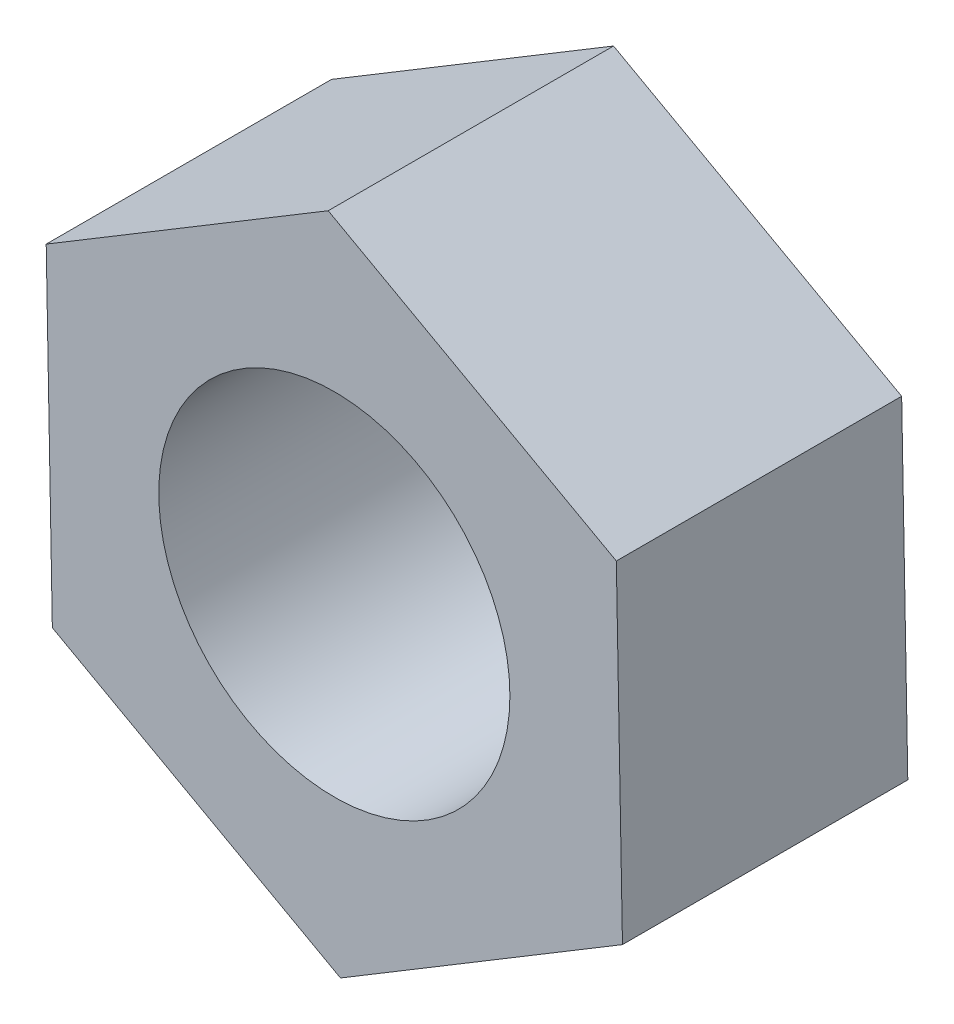
ISO-10303-21;
HEADER;
FILE_DESCRIPTION(('STEP AP214'),'2;1');
FILE_NAME('part.step','',(''),(''),'','','');
FILE_SCHEMA(('AUTOMOTIVE_DESIGN { 1 0 10303 214 1 1 1 1 }'));
ENDSEC;
DATA;
#1=APPLICATION_CONTEXT('core data for automotive mechanical design processes');
#2=APPLICATION_PROTOCOL_DEFINITION('international standard','automotive_design',2000,#1);
#3=PRODUCT_CONTEXT('',#1,'mechanical');
#4=PRODUCT('Part','Part','',(#3));
#5=PRODUCT_RELATED_PRODUCT_CATEGORY('part','',(#4));
#6=PRODUCT_DEFINITION_FORMATION('','',#4);
#7=PRODUCT_DEFINITION_CONTEXT('part definition',#1,'design');
#8=PRODUCT_DEFINITION('design','',#6,#7);
#9=PRODUCT_DEFINITION_SHAPE('','',#8);
#10=(LENGTH_UNIT() NAMED_UNIT(*) SI_UNIT(.MILLI.,.METRE.));
#11=(NAMED_UNIT(*) PLANE_ANGLE_UNIT() SI_UNIT($,.RADIAN.));
#12=(NAMED_UNIT(*) SI_UNIT($,.STERADIAN.) SOLID_ANGLE_UNIT());
#13=UNCERTAINTY_MEASURE_WITH_UNIT(LENGTH_MEASURE(1.E-05),#10,'distance_accuracy_value','');
#14=(GEOMETRIC_REPRESENTATION_CONTEXT(3) GLOBAL_UNCERTAINTY_ASSIGNED_CONTEXT((#13)) GLOBAL_UNIT_ASSIGNED_CONTEXT((#10,
#11,#12)) REPRESENTATION_CONTEXT('',''));
#15=CARTESIAN_POINT('',(0.,0.,0.));
#16=DIRECTION('',(0.,0.,1.));
#17=DIRECTION('',(1.,0.,0.));
#18=AXIS2_PLACEMENT_3D('',#15,#16,#17);
#19=CARTESIAN_POINT('',(0.,0.,6.5));
#20=DIRECTION('',(0.,0.,1.));
#21=DIRECTION('',(1.,0.,0.));
#22=AXIS2_PLACEMENT_3D('',#19,#20,#21);
#23=PLANE('',#22);
#24=DIRECTION('',(-0.856549125317095,-0.516065495764365,0.));
#25=VECTOR('',#24,1.);
#26=CARTESIAN_POINT('',(-0.13988450017504,7.49869537497095,6.5));
#27=LINE('',#26,#25);
#28=CARTESIAN_POINT('',(-0.13988450017504,7.49869537497095,6.5));
#29=VERTEX_POINT('',#28);
#30=CARTESIAN_POINT('',(-6.56400294005324,3.62820415673822,6.5));
#31=VERTEX_POINT('',#30);
#32=EDGE_CURVE('E129',#29,#31,#27,.T.);
#33=ORIENTED_EDGE('',*,*,#32,.T.);
#34=DIRECTION('',(0.0186512666900041,-0.999826049996127,0.));
#35=VECTOR('',#34,1.);
#36=CARTESIAN_POINT('',(-6.56400294005324,3.62820415673822,6.5));
#37=LINE('',#36,#35);
#38=CARTESIAN_POINT('',(-6.4241184398782,-3.87049121823275,6.5));
#39=VERTEX_POINT('',#38);
#40=EDGE_CURVE('E87',#31,#39,#37,.T.);
#41=ORIENTED_EDGE('',*,*,#40,.T.);
#42=DIRECTION('',(0.875200392007099,-0.483760554231761,0.));
#43=VECTOR('',#42,1.);
#44=CARTESIAN_POINT('',(-6.4241184398782,-3.87049121823275,6.5));
#45=LINE('',#44,#43);
#46=CARTESIAN_POINT('',(0.139884500175033,-7.49869537497095,6.5));
#47=VERTEX_POINT('',#46);
#48=EDGE_CURVE('E100',#39,#47,#45,.T.);
#49=ORIENTED_EDGE('',*,*,#48,.T.);
#50=DIRECTION('',(0.856549125317093,0.516065495764367,0.));
#51=VECTOR('',#50,1.);
#52=CARTESIAN_POINT('',(0.139884500175033,-7.49869537497095,6.5));
#53=LINE('',#52,#51);
#54=CARTESIAN_POINT('',(6.56400294005323,-3.62820415673821,6.5));
#55=VERTEX_POINT('',#54);
#56=EDGE_CURVE('E94',#47,#55,#53,.T.);
#57=ORIENTED_EDGE('',*,*,#56,.T.);
#58=DIRECTION('',(-0.0186512666900045,0.999826049996127,0.));
#59=VECTOR('',#58,1.);
#60=CARTESIAN_POINT('',(6.56400294005323,-3.62820415673821,6.5));
#61=LINE('',#60,#59);
#62=CARTESIAN_POINT('',(6.42411843987819,3.87049121823273,6.5));
#63=VERTEX_POINT('',#62);
#64=EDGE_CURVE('E98',#55,#63,#61,.T.);
#65=ORIENTED_EDGE('',*,*,#64,.T.);
#66=DIRECTION('',(-0.875200392007098,0.483760554231762,0.));
#67=VECTOR('',#66,1.);
#68=CARTESIAN_POINT('',(6.42411843987819,3.87049121823273,6.5));
#69=LINE('',#68,#67);
#70=EDGE_CURVE('E50',#63,#29,#69,.T.);
#71=ORIENTED_EDGE('',*,*,#70,.T.);
#72=EDGE_LOOP('',(#33,#41,#49,#57,#65,#71));
#73=FACE_BOUND('',#72,.T.);
#74=CARTESIAN_POINT('',(0.,0.,6.5));
#75=DIRECTION('',(0.,0.,1.));
#76=DIRECTION('',(1.,0.,0.));
#77=AXIS2_PLACEMENT_3D('',#74,#75,#76);
#78=CIRCLE('',#77,4.);
#79=CARTESIAN_POINT('',(4.,0.,6.5));
#80=VERTEX_POINT('',#79);
#81=EDGE_CURVE('E122',#80,#80,#78,.T.);
#82=ORIENTED_EDGE('',*,*,#81,.F.);
#83=EDGE_LOOP('',(#82));
#84=FACE_BOUND('',#83,.T.);
#85=ADVANCED_FACE('F33',(#73,#84),#23,.T.);
#86=CARTESIAN_POINT('',(0.,0.,0.));
#87=DIRECTION('',(0.,0.,1.));
#88=DIRECTION('',(1.,0.,0.));
#89=AXIS2_PLACEMENT_3D('',#86,#87,#88);
#90=PLANE('',#89);
#91=DIRECTION('',(-0.856549125317095,-0.516065495764365,0.));
#92=VECTOR('',#91,1.);
#93=CARTESIAN_POINT('',(-0.13988450017504,7.49869537497095,0.));
#94=LINE('',#93,#92);
#95=CARTESIAN_POINT('',(-0.13988450017504,7.49869537497095,0.));
#96=VERTEX_POINT('',#95);
#97=CARTESIAN_POINT('',(-6.56400294005324,3.62820415673822,0.));
#98=VERTEX_POINT('',#97);
#99=EDGE_CURVE('E118',#96,#98,#94,.T.);
#100=ORIENTED_EDGE('',*,*,#99,.F.);
#101=DIRECTION('',(-0.875200392007098,0.483760554231762,0.));
#102=VECTOR('',#101,1.);
#103=CARTESIAN_POINT('',(6.42411843987819,3.87049121823273,0.));
#104=LINE('',#103,#102);
#105=CARTESIAN_POINT('',(6.42411843987819,3.87049121823273,0.));
#106=VERTEX_POINT('',#105);
#107=EDGE_CURVE('E79',#106,#96,#104,.T.);
#108=ORIENTED_EDGE('',*,*,#107,.F.);
#109=DIRECTION('',(-0.0186512666900045,0.999826049996127,0.));
#110=VECTOR('',#109,1.);
#111=CARTESIAN_POINT('',(6.56400294005323,-3.62820415673821,0.));
#112=LINE('',#111,#110);
#113=CARTESIAN_POINT('',(6.56400294005323,-3.62820415673821,0.));
#114=VERTEX_POINT('',#113);
#115=EDGE_CURVE('E73',#114,#106,#112,.T.);
#116=ORIENTED_EDGE('',*,*,#115,.F.);
#117=DIRECTION('',(0.856549125317093,0.516065495764367,0.));
#118=VECTOR('',#117,1.);
#119=CARTESIAN_POINT('',(0.139884500175033,-7.49869537497095,0.));
#120=LINE('',#119,#118);
#121=CARTESIAN_POINT('',(0.139884500175033,-7.49869537497095,0.));
#122=VERTEX_POINT('',#121);
#123=EDGE_CURVE('E108',#122,#114,#120,.T.);
#124=ORIENTED_EDGE('',*,*,#123,.F.);
#125=DIRECTION('',(0.875200392007099,-0.483760554231761,0.));
#126=VECTOR('',#125,1.);
#127=CARTESIAN_POINT('',(-6.4241184398782,-3.87049121823275,0.));
#128=LINE('',#127,#126);
#129=CARTESIAN_POINT('',(-6.4241184398782,-3.87049121823275,0.));
#130=VERTEX_POINT('',#129);
#131=EDGE_CURVE('E124',#130,#122,#128,.T.);
#132=ORIENTED_EDGE('',*,*,#131,.F.);
#133=DIRECTION('',(0.0186512666900041,-0.999826049996127,0.));
#134=VECTOR('',#133,1.);
#135=CARTESIAN_POINT('',(-6.56400294005324,3.62820415673822,0.));
#136=LINE('',#135,#134);
#137=EDGE_CURVE('E121',#98,#130,#136,.T.);
#138=ORIENTED_EDGE('',*,*,#137,.F.);
#139=EDGE_LOOP('',(#100,#108,#116,#124,#132,#138));
#140=FACE_BOUND('',#139,.T.);
#141=CARTESIAN_POINT('',(0.,0.,0.));
#142=DIRECTION('',(0.,0.,1.));
#143=DIRECTION('',(1.,0.,0.));
#144=AXIS2_PLACEMENT_3D('',#141,#142,#143);
#145=CIRCLE('',#144,4.);
#146=CARTESIAN_POINT('',(4.,0.,0.));
#147=VERTEX_POINT('',#146);
#148=EDGE_CURVE('E222',#147,#147,#145,.T.);
#149=ORIENTED_EDGE('',*,*,#148,.T.);
#150=EDGE_LOOP('',(#149));
#151=FACE_BOUND('',#150,.T.);
#152=ADVANCED_FACE('F138',(#140,#151),#90,.F.);
#153=CARTESIAN_POINT('',(-0.13988450017504,7.49869537497095,6.5));
#154=DIRECTION('',(0.516065495764365,-0.856549125317095,0.));
#155=DIRECTION('',(0.856549125317095,0.516065495764365,0.));
#156=AXIS2_PLACEMENT_3D('',#153,#154,#155);
#157=PLANE('',#156);
#158=ORIENTED_EDGE('',*,*,#99,.T.);
#159=DIRECTION('',(0.,0.,-1.));
#160=VECTOR('',#159,1.);
#161=CARTESIAN_POINT('',(-6.56400294005324,3.62820415673822,6.5));
#162=LINE('',#161,#160);
#163=EDGE_CURVE('E11',#31,#98,#162,.T.);
#164=ORIENTED_EDGE('',*,*,#163,.F.);
#165=ORIENTED_EDGE('',*,*,#32,.F.);
#166=DIRECTION('',(0.,0.,-1.));
#167=VECTOR('',#166,1.);
#168=CARTESIAN_POINT('',(-0.13988450017504,7.49869537497095,6.5));
#169=LINE('',#168,#167);
#170=EDGE_CURVE('E114',#29,#96,#169,.T.);
#171=ORIENTED_EDGE('',*,*,#170,.T.);
#172=EDGE_LOOP('',(#158,#164,#165,#171));
#173=FACE_BOUND('',#172,.T.);
#174=ADVANCED_FACE('F35',(#173),#157,.F.);
#175=CARTESIAN_POINT('',(-6.56400294005324,3.62820415673822,6.5));
#176=DIRECTION('',(0.999826049996127,0.0186512666900041,0.));
#177=DIRECTION('',(-0.0186512666900041,0.999826049996127,0.));
#178=AXIS2_PLACEMENT_3D('',#175,#176,#177);
#179=PLANE('',#178);
#180=ORIENTED_EDGE('',*,*,#137,.T.);
#181=DIRECTION('',(0.,0.,-1.));
#182=VECTOR('',#181,1.);
#183=CARTESIAN_POINT('',(-6.4241184398782,-3.87049121823275,6.5));
#184=LINE('',#183,#182);
#185=EDGE_CURVE('E42',#39,#130,#184,.T.);
#186=ORIENTED_EDGE('',*,*,#185,.F.);
#187=ORIENTED_EDGE('',*,*,#40,.F.);
#188=ORIENTED_EDGE('',*,*,#163,.T.);
#189=EDGE_LOOP('',(#180,#186,#187,#188));
#190=FACE_BOUND('',#189,.T.);
#191=ADVANCED_FACE('F163',(#190),#179,.F.);
#192=CARTESIAN_POINT('',(-6.4241184398782,-3.87049121823275,6.5));
#193=DIRECTION('',(0.483760554231761,0.875200392007099,0.));
#194=DIRECTION('',(-0.875200392007099,0.483760554231761,0.));
#195=AXIS2_PLACEMENT_3D('',#192,#193,#194);
#196=PLANE('',#195);
#197=ORIENTED_EDGE('',*,*,#131,.T.);
#198=DIRECTION('',(0.,0.,-1.));
#199=VECTOR('',#198,1.);
#200=CARTESIAN_POINT('',(0.139884500175033,-7.49869537497095,6.5));
#201=LINE('',#200,#199);
#202=EDGE_CURVE('E109',#47,#122,#201,.T.);
#203=ORIENTED_EDGE('',*,*,#202,.F.);
#204=ORIENTED_EDGE('',*,*,#48,.F.);
#205=ORIENTED_EDGE('',*,*,#185,.T.);
#206=EDGE_LOOP('',(#197,#203,#204,#205));
#207=FACE_BOUND('',#206,.T.);
#208=ADVANCED_FACE('F135',(#207),#196,.F.);
#209=CARTESIAN_POINT('',(0.139884500175033,-7.49869537497095,6.5));
#210=DIRECTION('',(-0.516065495764367,0.856549125317093,0.));
#211=DIRECTION('',(-0.856549125317093,-0.516065495764367,0.));
#212=AXIS2_PLACEMENT_3D('',#209,#210,#211);
#213=PLANE('',#212);
#214=ORIENTED_EDGE('',*,*,#123,.T.);
#215=DIRECTION('',(0.,0.,-1.));
#216=VECTOR('',#215,1.);
#217=CARTESIAN_POINT('',(6.56400294005323,-3.62820415673821,6.5));
#218=LINE('',#217,#216);
#219=EDGE_CURVE('E105',#55,#114,#218,.T.);
#220=ORIENTED_EDGE('',*,*,#219,.F.);
#221=ORIENTED_EDGE('',*,*,#56,.F.);
#222=ORIENTED_EDGE('',*,*,#202,.T.);
#223=EDGE_LOOP('',(#214,#220,#221,#222));
#224=FACE_BOUND('',#223,.T.);
#225=ADVANCED_FACE('F106',(#224),#213,.F.);
#226=CARTESIAN_POINT('',(6.56400294005323,-3.62820415673821,6.5));
#227=DIRECTION('',(-0.999826049996127,-0.0186512666900045,0.));
#228=DIRECTION('',(0.0186512666900045,-0.999826049996127,0.));
#229=AXIS2_PLACEMENT_3D('',#226,#227,#228);
#230=PLANE('',#229);
#231=ORIENTED_EDGE('',*,*,#115,.T.);
#232=DIRECTION('',(0.,0.,-1.));
#233=VECTOR('',#232,1.);
#234=CARTESIAN_POINT('',(6.42411843987819,3.87049121823273,6.5));
#235=LINE('',#234,#233);
#236=EDGE_CURVE('E110',#63,#106,#235,.T.);
#237=ORIENTED_EDGE('',*,*,#236,.F.);
#238=ORIENTED_EDGE('',*,*,#64,.F.);
#239=ORIENTED_EDGE('',*,*,#219,.T.);
#240=EDGE_LOOP('',(#231,#237,#238,#239));
#241=FACE_BOUND('',#240,.T.);
#242=ADVANCED_FACE('F112',(#241),#230,.F.);
#243=CARTESIAN_POINT('',(6.42411843987819,3.87049121823273,6.5));
#244=DIRECTION('',(-0.483760554231762,-0.875200392007098,0.));
#245=DIRECTION('',(0.875200392007098,-0.483760554231762,0.));
#246=AXIS2_PLACEMENT_3D('',#243,#244,#245);
#247=PLANE('',#246);
#248=ORIENTED_EDGE('',*,*,#107,.T.);
#249=ORIENTED_EDGE('',*,*,#170,.F.);
#250=ORIENTED_EDGE('',*,*,#70,.F.);
#251=ORIENTED_EDGE('',*,*,#236,.T.);
#252=EDGE_LOOP('',(#248,#249,#250,#251));
#253=FACE_BOUND('',#252,.T.);
#254=ADVANCED_FACE('F143',(#253),#247,.F.);
#255=CARTESIAN_POINT('',(0.,0.,6.5));
#256=DIRECTION('',(0.,0.,-1.));
#257=DIRECTION('',(-1.,0.,0.));
#258=AXIS2_PLACEMENT_3D('',#255,#256,#257);
#259=CYLINDRICAL_SURFACE('',#258,4.);
#260=ORIENTED_EDGE('',*,*,#81,.T.);
#261=EDGE_LOOP('',(#260));
#262=FACE_BOUND('',#261,.T.);
#263=ORIENTED_EDGE('',*,*,#148,.F.);
#264=EDGE_LOOP('',(#263));
#265=FACE_BOUND('',#264,.T.);
#266=ADVANCED_FACE('F145',(#262,#265),#259,.F.);
#267=CLOSED_SHELL('',(#85,#152,#174,#191,#208,#225,#242,#254,#266));
#268=MANIFOLD_SOLID_BREP('B2',#267);
#269=ADVANCED_BREP_SHAPE_REPRESENTATION('',(#18,#268),#14);
#270=SHAPE_DEFINITION_REPRESENTATION(#9,#269);
ENDSEC;
END-ISO-10303-21;
